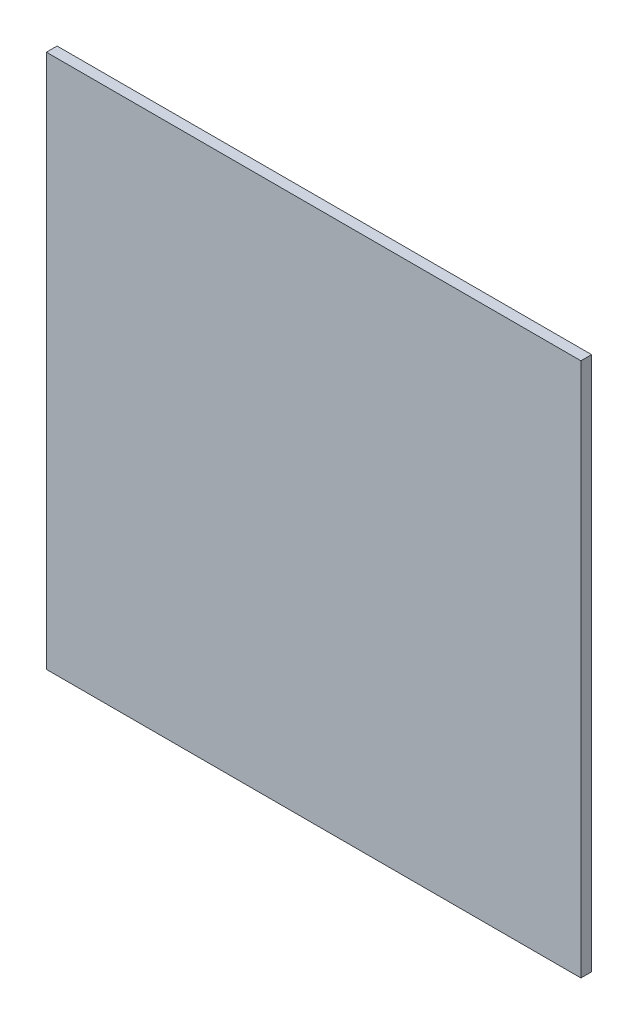
ISO-10303-21;
HEADER;
FILE_DESCRIPTION(('STEP AP214'),'2;1');
FILE_NAME('part.step','',(''),(''),'','','');
FILE_SCHEMA(('AUTOMOTIVE_DESIGN { 1 0 10303 214 1 1 1 1 }'));
ENDSEC;
DATA;
#1=APPLICATION_CONTEXT('core data for automotive mechanical design processes');
#2=APPLICATION_PROTOCOL_DEFINITION('international standard','automotive_design',2000,#1);
#3=PRODUCT_CONTEXT('',#1,'mechanical');
#4=PRODUCT('Part','Part','',(#3));
#5=PRODUCT_RELATED_PRODUCT_CATEGORY('part','',(#4));
#6=PRODUCT_DEFINITION_FORMATION('','',#4);
#7=PRODUCT_DEFINITION_CONTEXT('part definition',#1,'design');
#8=PRODUCT_DEFINITION('design','',#6,#7);
#9=PRODUCT_DEFINITION_SHAPE('','',#8);
#10=(LENGTH_UNIT() NAMED_UNIT(*) SI_UNIT(.MILLI.,.METRE.));
#11=(NAMED_UNIT(*) PLANE_ANGLE_UNIT() SI_UNIT($,.RADIAN.));
#12=(NAMED_UNIT(*) SI_UNIT($,.STERADIAN.) SOLID_ANGLE_UNIT());
#13=UNCERTAINTY_MEASURE_WITH_UNIT(LENGTH_MEASURE(1.E-05),#10,'distance_accuracy_value','');
#14=(GEOMETRIC_REPRESENTATION_CONTEXT(3) GLOBAL_UNCERTAINTY_ASSIGNED_CONTEXT((#13)) GLOBAL_UNIT_ASSIGNED_CONTEXT((#10,
#11,#12)) REPRESENTATION_CONTEXT('',''));
#15=CARTESIAN_POINT('',(0.,0.,0.));
#16=DIRECTION('',(0.,0.,1.));
#17=DIRECTION('',(1.,0.,0.));
#18=AXIS2_PLACEMENT_3D('',#15,#16,#17);
#19=CARTESIAN_POINT('',(-500.,-500.,20.));
#20=DIRECTION('',(1.,0.,0.));
#21=DIRECTION('',(0.,0.,-1.));
#22=AXIS2_PLACEMENT_3D('',#19,#20,#21);
#23=PLANE('',#22);
#24=DIRECTION('',(0.,-1.,0.));
#25=VECTOR('',#24,1.);
#26=CARTESIAN_POINT('',(-500.,-500.,0.));
#27=LINE('',#26,#25);
#28=CARTESIAN_POINT('',(-500.,500.,0.));
#29=VERTEX_POINT('',#28);
#30=CARTESIAN_POINT('',(-500.,-500.,0.));
#31=VERTEX_POINT('',#30);
#32=EDGE_CURVE('E96',#29,#31,#27,.T.);
#33=ORIENTED_EDGE('',*,*,#32,.T.);
#34=DIRECTION('',(0.,0.,-1.));
#35=VECTOR('',#34,1.);
#36=CARTESIAN_POINT('',(-500.,-500.,20.));
#37=LINE('',#36,#35);
#38=CARTESIAN_POINT('',(-500.,-500.,20.));
#39=VERTEX_POINT('',#38);
#40=EDGE_CURVE('E11',#39,#31,#37,.T.);
#41=ORIENTED_EDGE('',*,*,#40,.F.);
#42=DIRECTION('',(0.,-1.,0.));
#43=VECTOR('',#42,1.);
#44=CARTESIAN_POINT('',(-500.,-500.,20.));
#45=LINE('',#44,#43);
#46=CARTESIAN_POINT('',(-500.,500.,20.));
#47=VERTEX_POINT('',#46);
#48=EDGE_CURVE('E84',#47,#39,#45,.T.);
#49=ORIENTED_EDGE('',*,*,#48,.F.);
#50=DIRECTION('',(0.,0.,-1.));
#51=VECTOR('',#50,1.);
#52=CARTESIAN_POINT('',(-500.,500.,20.));
#53=LINE('',#52,#51);
#54=EDGE_CURVE('E92',#47,#29,#53,.T.);
#55=ORIENTED_EDGE('',*,*,#54,.T.);
#56=EDGE_LOOP('',(#33,#41,#49,#55));
#57=FACE_BOUND('',#56,.T.);
#58=ADVANCED_FACE('F33',(#57),#23,.F.);
#59=CARTESIAN_POINT('',(500.,-500.,20.));
#60=DIRECTION('',(0.,1.,0.));
#61=DIRECTION('',(-1.,0.,0.));
#62=AXIS2_PLACEMENT_3D('',#59,#60,#61);
#63=PLANE('',#62);
#64=DIRECTION('',(1.,0.,0.));
#65=VECTOR('',#64,1.);
#66=CARTESIAN_POINT('',(500.,-500.,0.));
#67=LINE('',#66,#65);
#68=CARTESIAN_POINT('',(500.,-500.,0.));
#69=VERTEX_POINT('',#68);
#70=EDGE_CURVE('E88',#31,#69,#67,.T.);
#71=ORIENTED_EDGE('',*,*,#70,.T.);
#72=DIRECTION('',(0.,0.,-1.));
#73=VECTOR('',#72,1.);
#74=CARTESIAN_POINT('',(500.,-500.,20.));
#75=LINE('',#74,#73);
#76=CARTESIAN_POINT('',(500.,-500.,20.));
#77=VERTEX_POINT('',#76);
#78=EDGE_CURVE('E41',#77,#69,#75,.T.);
#79=ORIENTED_EDGE('',*,*,#78,.F.);
#80=DIRECTION('',(1.,0.,0.));
#81=VECTOR('',#80,1.);
#82=CARTESIAN_POINT('',(500.,-500.,20.));
#83=LINE('',#82,#81);
#84=EDGE_CURVE('E79',#39,#77,#83,.T.);
#85=ORIENTED_EDGE('',*,*,#84,.F.);
#86=ORIENTED_EDGE('',*,*,#40,.T.);
#87=EDGE_LOOP('',(#71,#79,#85,#86));
#88=FACE_BOUND('',#87,.T.);
#89=ADVANCED_FACE('F87',(#88),#63,.F.);
#90=CARTESIAN_POINT('',(500.,-500.,20.));
#91=DIRECTION('',(-1.,0.,0.));
#92=DIRECTION('',(0.,0.,1.));
#93=AXIS2_PLACEMENT_3D('',#90,#91,#92);
#94=PLANE('',#93);
#95=DIRECTION('',(0.,1.,0.));
#96=VECTOR('',#95,1.);
#97=CARTESIAN_POINT('',(500.,-500.,0.));
#98=LINE('',#97,#96);
#99=CARTESIAN_POINT('',(500.,500.,0.));
#100=VERTEX_POINT('',#99);
#101=EDGE_CURVE('E66',#69,#100,#98,.T.);
#102=ORIENTED_EDGE('',*,*,#101,.T.);
#103=DIRECTION('',(0.,0.,-1.));
#104=VECTOR('',#103,1.);
#105=CARTESIAN_POINT('',(500.,500.,20.));
#106=LINE('',#105,#104);
#107=CARTESIAN_POINT('',(500.,500.,20.));
#108=VERTEX_POINT('',#107);
#109=EDGE_CURVE('E89',#108,#100,#106,.T.);
#110=ORIENTED_EDGE('',*,*,#109,.F.);
#111=DIRECTION('',(0.,1.,0.));
#112=VECTOR('',#111,1.);
#113=CARTESIAN_POINT('',(500.,-500.,20.));
#114=LINE('',#113,#112);
#115=EDGE_CURVE('E82',#77,#108,#114,.T.);
#116=ORIENTED_EDGE('',*,*,#115,.F.);
#117=ORIENTED_EDGE('',*,*,#78,.T.);
#118=EDGE_LOOP('',(#102,#110,#116,#117));
#119=FACE_BOUND('',#118,.T.);
#120=ADVANCED_FACE('F90',(#119),#94,.F.);
#121=CARTESIAN_POINT('',(500.,500.,20.));
#122=DIRECTION('',(0.,-1.,0.));
#123=DIRECTION('',(1.,0.,0.));
#124=AXIS2_PLACEMENT_3D('',#121,#122,#123);
#125=PLANE('',#124);
#126=DIRECTION('',(-1.,0.,0.));
#127=VECTOR('',#126,1.);
#128=CARTESIAN_POINT('',(500.,500.,0.));
#129=LINE('',#128,#127);
#130=EDGE_CURVE('E72',#100,#29,#129,.T.);
#131=ORIENTED_EDGE('',*,*,#130,.T.);
#132=ORIENTED_EDGE('',*,*,#54,.F.);
#133=DIRECTION('',(-1.,0.,0.));
#134=VECTOR('',#133,1.);
#135=CARTESIAN_POINT('',(500.,500.,20.));
#136=LINE('',#135,#134);
#137=EDGE_CURVE('E49',#108,#47,#136,.T.);
#138=ORIENTED_EDGE('',*,*,#137,.F.);
#139=ORIENTED_EDGE('',*,*,#109,.T.);
#140=EDGE_LOOP('',(#131,#132,#138,#139));
#141=FACE_BOUND('',#140,.T.);
#142=ADVANCED_FACE('F103',(#141),#125,.F.);
#143=CARTESIAN_POINT('',(0.,0.,20.));
#144=DIRECTION('',(0.,0.,1.));
#145=DIRECTION('',(1.,0.,0.));
#146=AXIS2_PLACEMENT_3D('',#143,#144,#145);
#147=PLANE('',#146);
#148=ORIENTED_EDGE('',*,*,#48,.T.);
#149=ORIENTED_EDGE('',*,*,#84,.T.);
#150=ORIENTED_EDGE('',*,*,#115,.T.);
#151=ORIENTED_EDGE('',*,*,#137,.T.);
#152=EDGE_LOOP('',(#148,#149,#150,#151));
#153=FACE_BOUND('',#152,.T.);
#154=ADVANCED_FACE('F80',(#153),#147,.T.);
#155=CARTESIAN_POINT('',(0.,0.,0.));
#156=DIRECTION('',(0.,0.,1.));
#157=DIRECTION('',(1.,0.,0.));
#158=AXIS2_PLACEMENT_3D('',#155,#156,#157);
#159=PLANE('',#158);
#160=ORIENTED_EDGE('',*,*,#32,.F.);
#161=ORIENTED_EDGE('',*,*,#130,.F.);
#162=ORIENTED_EDGE('',*,*,#101,.F.);
#163=ORIENTED_EDGE('',*,*,#70,.F.);
#164=EDGE_LOOP('',(#160,#161,#162,#163));
#165=FACE_BOUND('',#164,.T.);
#166=ADVANCED_FACE('F106',(#165),#159,.F.);
#167=CLOSED_SHELL('',(#58,#89,#120,#142,#154,#166));
#168=MANIFOLD_SOLID_BREP('B2',#167);
#169=ADVANCED_BREP_SHAPE_REPRESENTATION('',(#18,#168),#14);
#170=SHAPE_DEFINITION_REPRESENTATION(#9,#169);
ENDSEC;
END-ISO-10303-21;
